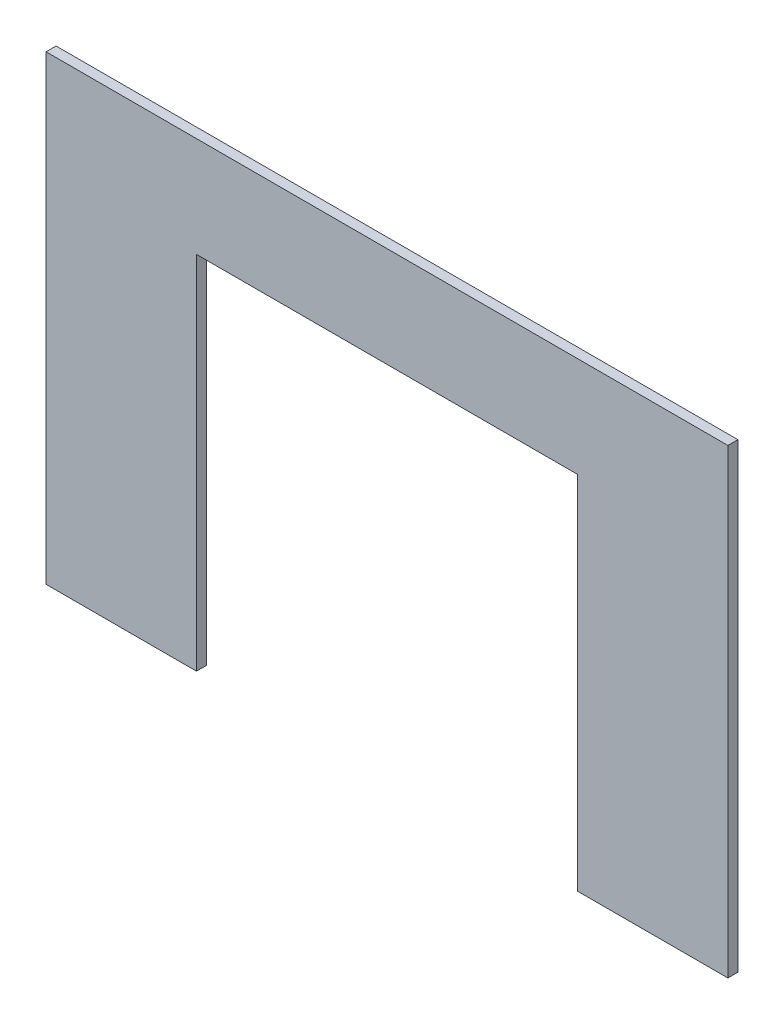
ISO-10303-21;
HEADER;
FILE_DESCRIPTION(('STEP AP214'),'2;1');
FILE_NAME('part.step','',(''),(''),'','','');
FILE_SCHEMA(('AUTOMOTIVE_DESIGN { 1 0 10303 214 1 1 1 1 }'));
ENDSEC;
DATA;
#1=APPLICATION_CONTEXT('core data for automotive mechanical design processes');
#2=APPLICATION_PROTOCOL_DEFINITION('international standard','automotive_design',2000,#1);
#3=PRODUCT_CONTEXT('',#1,'mechanical');
#4=PRODUCT('Part','Part','',(#3));
#5=PRODUCT_RELATED_PRODUCT_CATEGORY('part','',(#4));
#6=PRODUCT_DEFINITION_FORMATION('','',#4);
#7=PRODUCT_DEFINITION_CONTEXT('part definition',#1,'design');
#8=PRODUCT_DEFINITION('design','',#6,#7);
#9=PRODUCT_DEFINITION_SHAPE('','',#8);
#10=(LENGTH_UNIT() NAMED_UNIT(*) SI_UNIT(.MILLI.,.METRE.));
#11=(NAMED_UNIT(*) PLANE_ANGLE_UNIT() SI_UNIT($,.RADIAN.));
#12=(NAMED_UNIT(*) SI_UNIT($,.STERADIAN.) SOLID_ANGLE_UNIT());
#13=UNCERTAINTY_MEASURE_WITH_UNIT(LENGTH_MEASURE(1.E-05),#10,'distance_accuracy_value','');
#14=(GEOMETRIC_REPRESENTATION_CONTEXT(3) GLOBAL_UNCERTAINTY_ASSIGNED_CONTEXT((#13)) GLOBAL_UNIT_ASSIGNED_CONTEXT((#10,
#11,#12)) REPRESENTATION_CONTEXT('',''));
#15=CARTESIAN_POINT('',(0.,0.,0.));
#16=DIRECTION('',(0.,0.,1.));
#17=DIRECTION('',(1.,0.,0.));
#18=AXIS2_PLACEMENT_3D('',#15,#16,#17);
#19=CARTESIAN_POINT('',(431.8,304.8,6.35));
#20=DIRECTION('',(-1.,0.,0.));
#21=DIRECTION('',(0.,0.,1.));
#22=AXIS2_PLACEMENT_3D('',#19,#20,#21);
#23=PLANE('',#22);
#24=DIRECTION('',(0.,1.,0.));
#25=VECTOR('',#24,1.);
#26=CARTESIAN_POINT('',(431.8,304.8,0.));
#27=LINE('',#26,#25);
#28=CARTESIAN_POINT('',(431.8,12.7000000000001,0.));
#29=VERTEX_POINT('',#28);
#30=CARTESIAN_POINT('',(431.8,304.8,0.));
#31=VERTEX_POINT('',#30);
#32=EDGE_CURVE('E129',#29,#31,#27,.T.);
#33=ORIENTED_EDGE('',*,*,#32,.T.);
#34=DIRECTION('',(0.,0.,-1.));
#35=VECTOR('',#34,1.);
#36=CARTESIAN_POINT('',(431.8,304.8,6.35));
#37=LINE('',#36,#35);
#38=CARTESIAN_POINT('',(431.8,304.8,6.35));
#39=VERTEX_POINT('',#38);
#40=EDGE_CURVE('E11',#39,#31,#37,.T.);
#41=ORIENTED_EDGE('',*,*,#40,.F.);
#42=DIRECTION('',(0.,1.,0.));
#43=VECTOR('',#42,1.);
#44=CARTESIAN_POINT('',(431.8,304.8,6.35));
#45=LINE('',#44,#43);
#46=CARTESIAN_POINT('',(431.8,12.7000000000001,6.35));
#47=VERTEX_POINT('',#46);
#48=EDGE_CURVE('E143',#47,#39,#45,.T.);
#49=ORIENTED_EDGE('',*,*,#48,.F.);
#50=DIRECTION('',(0.,0.,-1.));
#51=VECTOR('',#50,1.);
#52=CARTESIAN_POINT('',(431.8,12.7000000000001,6.35));
#53=LINE('',#52,#51);
#54=EDGE_CURVE('E125',#47,#29,#53,.T.);
#55=ORIENTED_EDGE('',*,*,#54,.T.);
#56=EDGE_LOOP('',(#33,#41,#49,#55));
#57=FACE_BOUND('',#56,.T.);
#58=ADVANCED_FACE('F33',(#57),#23,.F.);
#59=CARTESIAN_POINT('',(0.,304.8,6.35));
#60=DIRECTION('',(0.,-1.,0.));
#61=DIRECTION('',(0.,0.,-1.));
#62=AXIS2_PLACEMENT_3D('',#59,#60,#61);
#63=PLANE('',#62);
#64=DIRECTION('',(-1.,0.,0.));
#65=VECTOR('',#64,1.);
#66=CARTESIAN_POINT('',(0.,304.8,0.));
#67=LINE('',#66,#65);
#68=CARTESIAN_POINT('',(0.,304.8,0.));
#69=VERTEX_POINT('',#68);
#70=EDGE_CURVE('E132',#31,#69,#67,.T.);
#71=ORIENTED_EDGE('',*,*,#70,.T.);
#72=DIRECTION('',(0.,0.,-1.));
#73=VECTOR('',#72,1.);
#74=CARTESIAN_POINT('',(0.,304.8,6.35));
#75=LINE('',#74,#73);
#76=CARTESIAN_POINT('',(0.,304.8,6.35));
#77=VERTEX_POINT('',#76);
#78=EDGE_CURVE('E41',#77,#69,#75,.T.);
#79=ORIENTED_EDGE('',*,*,#78,.F.);
#80=DIRECTION('',(-1.,0.,0.));
#81=VECTOR('',#80,1.);
#82=CARTESIAN_POINT('',(0.,304.8,6.35));
#83=LINE('',#82,#81);
#84=EDGE_CURVE('E92',#39,#77,#83,.T.);
#85=ORIENTED_EDGE('',*,*,#84,.F.);
#86=ORIENTED_EDGE('',*,*,#40,.T.);
#87=EDGE_LOOP('',(#71,#79,#85,#86));
#88=FACE_BOUND('',#87,.T.);
#89=ADVANCED_FACE('F178',(#88),#63,.F.);
#90=CARTESIAN_POINT('',(0.,12.7,6.35));
#91=DIRECTION('',(1.,0.,0.));
#92=DIRECTION('',(0.,0.,-1.));
#93=AXIS2_PLACEMENT_3D('',#90,#91,#92);
#94=PLANE('',#93);
#95=DIRECTION('',(0.,-1.,0.));
#96=VECTOR('',#95,1.);
#97=CARTESIAN_POINT('',(0.,12.7,0.));
#98=LINE('',#97,#96);
#99=CARTESIAN_POINT('',(0.,12.7,0.));
#100=VERTEX_POINT('',#99);
#101=EDGE_CURVE('E134',#69,#100,#98,.T.);
#102=ORIENTED_EDGE('',*,*,#101,.T.);
#103=DIRECTION('',(0.,0.,-1.));
#104=VECTOR('',#103,1.);
#105=CARTESIAN_POINT('',(0.,12.7,6.35));
#106=LINE('',#105,#104);
#107=CARTESIAN_POINT('',(0.,12.7,6.35));
#108=VERTEX_POINT('',#107);
#109=EDGE_CURVE('E150',#108,#100,#106,.T.);
#110=ORIENTED_EDGE('',*,*,#109,.F.);
#111=DIRECTION('',(0.,-1.,0.));
#112=VECTOR('',#111,1.);
#113=CARTESIAN_POINT('',(0.,12.7,6.35));
#114=LINE('',#113,#112);
#115=EDGE_CURVE('E158',#77,#108,#114,.T.);
#116=ORIENTED_EDGE('',*,*,#115,.F.);
#117=ORIENTED_EDGE('',*,*,#78,.T.);
#118=EDGE_LOOP('',(#102,#110,#116,#117));
#119=FACE_BOUND('',#118,.T.);
#120=ADVANCED_FACE('F156',(#119),#94,.F.);
#121=CARTESIAN_POINT('',(95.25,12.7,6.35));
#122=DIRECTION('',(0.,1.,0.));
#123=DIRECTION('',(-1.,0.,0.));
#124=AXIS2_PLACEMENT_3D('',#121,#122,#123);
#125=PLANE('',#124);
#126=DIRECTION('',(1.,0.,0.));
#127=VECTOR('',#126,1.);
#128=CARTESIAN_POINT('',(95.25,12.7,0.));
#129=LINE('',#128,#127);
#130=CARTESIAN_POINT('',(95.25,12.7,0.));
#131=VERTEX_POINT('',#130);
#132=EDGE_CURVE('E136',#100,#131,#129,.T.);
#133=ORIENTED_EDGE('',*,*,#132,.T.);
#134=DIRECTION('',(0.,0.,-1.));
#135=VECTOR('',#134,1.);
#136=CARTESIAN_POINT('',(95.25,12.7,6.35));
#137=LINE('',#136,#135);
#138=CARTESIAN_POINT('',(95.25,12.7,6.35));
#139=VERTEX_POINT('',#138);
#140=EDGE_CURVE('E147',#139,#131,#137,.T.);
#141=ORIENTED_EDGE('',*,*,#140,.F.);
#142=DIRECTION('',(1.,0.,0.));
#143=VECTOR('',#142,1.);
#144=CARTESIAN_POINT('',(95.25,12.7,6.35));
#145=LINE('',#144,#143);
#146=EDGE_CURVE('E170',#108,#139,#145,.T.);
#147=ORIENTED_EDGE('',*,*,#146,.F.);
#148=ORIENTED_EDGE('',*,*,#109,.T.);
#149=EDGE_LOOP('',(#133,#141,#147,#148));
#150=FACE_BOUND('',#149,.T.);
#151=ADVANCED_FACE('F166',(#150),#125,.F.);
#152=CARTESIAN_POINT('',(95.25,241.3,6.35));
#153=DIRECTION('',(-1.,0.,0.));
#154=DIRECTION('',(0.,-1.,0.));
#155=AXIS2_PLACEMENT_3D('',#152,#153,#154);
#156=PLANE('',#155);
#157=DIRECTION('',(0.,1.,0.));
#158=VECTOR('',#157,1.);
#159=CARTESIAN_POINT('',(95.25,241.3,0.));
#160=LINE('',#159,#158);
#161=CARTESIAN_POINT('',(95.25,241.3,0.));
#162=VERTEX_POINT('',#161);
#163=EDGE_CURVE('E138',#131,#162,#160,.T.);
#164=ORIENTED_EDGE('',*,*,#163,.T.);
#165=DIRECTION('',(0.,0.,-1.));
#166=VECTOR('',#165,1.);
#167=CARTESIAN_POINT('',(95.25,241.3,6.35));
#168=LINE('',#167,#166);
#169=CARTESIAN_POINT('',(95.25,241.3,6.35));
#170=VERTEX_POINT('',#169);
#171=EDGE_CURVE('E120',#170,#162,#168,.T.);
#172=ORIENTED_EDGE('',*,*,#171,.F.);
#173=DIRECTION('',(0.,1.,0.));
#174=VECTOR('',#173,1.);
#175=CARTESIAN_POINT('',(95.25,241.3,6.35));
#176=LINE('',#175,#174);
#177=EDGE_CURVE('E111',#139,#170,#176,.T.);
#178=ORIENTED_EDGE('',*,*,#177,.F.);
#179=ORIENTED_EDGE('',*,*,#140,.T.);
#180=EDGE_LOOP('',(#164,#172,#178,#179));
#181=FACE_BOUND('',#180,.T.);
#182=ADVANCED_FACE('F169',(#181),#156,.F.);
#183=CARTESIAN_POINT('',(336.55,241.3,6.35));
#184=DIRECTION('',(0.,1.,0.));
#185=DIRECTION('',(-1.,0.,0.));
#186=AXIS2_PLACEMENT_3D('',#183,#184,#185);
#187=PLANE('',#186);
#188=DIRECTION('',(1.,0.,0.));
#189=VECTOR('',#188,1.);
#190=CARTESIAN_POINT('',(336.55,241.3,0.));
#191=LINE('',#190,#189);
#192=CARTESIAN_POINT('',(336.55,241.3,0.));
#193=VERTEX_POINT('',#192);
#194=EDGE_CURVE('E119',#162,#193,#191,.T.);
#195=ORIENTED_EDGE('',*,*,#194,.T.);
#196=DIRECTION('',(0.,0.,-1.));
#197=VECTOR('',#196,1.);
#198=CARTESIAN_POINT('',(336.55,241.3,6.35));
#199=LINE('',#198,#197);
#200=CARTESIAN_POINT('',(336.55,241.3,6.35));
#201=VERTEX_POINT('',#200);
#202=EDGE_CURVE('E116',#201,#193,#199,.T.);
#203=ORIENTED_EDGE('',*,*,#202,.F.);
#204=DIRECTION('',(1.,0.,0.));
#205=VECTOR('',#204,1.);
#206=CARTESIAN_POINT('',(336.55,241.3,6.35));
#207=LINE('',#206,#205);
#208=EDGE_CURVE('E105',#170,#201,#207,.T.);
#209=ORIENTED_EDGE('',*,*,#208,.F.);
#210=ORIENTED_EDGE('',*,*,#171,.T.);
#211=EDGE_LOOP('',(#195,#203,#209,#210));
#212=FACE_BOUND('',#211,.T.);
#213=ADVANCED_FACE('F117',(#212),#187,.F.);
#214=CARTESIAN_POINT('',(336.55,12.7,6.35));
#215=DIRECTION('',(1.,0.,0.));
#216=DIRECTION('',(0.,0.,-1.));
#217=AXIS2_PLACEMENT_3D('',#214,#215,#216);
#218=PLANE('',#217);
#219=DIRECTION('',(0.,-1.,0.));
#220=VECTOR('',#219,1.);
#221=CARTESIAN_POINT('',(336.55,12.7,0.));
#222=LINE('',#221,#220);
#223=CARTESIAN_POINT('',(336.55,12.7,0.));
#224=VERTEX_POINT('',#223);
#225=EDGE_CURVE('E78',#193,#224,#222,.T.);
#226=ORIENTED_EDGE('',*,*,#225,.T.);
#227=DIRECTION('',(0.,0.,-1.));
#228=VECTOR('',#227,1.);
#229=CARTESIAN_POINT('',(336.55,12.7,6.35));
#230=LINE('',#229,#228);
#231=CARTESIAN_POINT('',(336.55,12.7,6.35));
#232=VERTEX_POINT('',#231);
#233=EDGE_CURVE('E121',#232,#224,#230,.T.);
#234=ORIENTED_EDGE('',*,*,#233,.F.);
#235=DIRECTION('',(0.,-1.,0.));
#236=VECTOR('',#235,1.);
#237=CARTESIAN_POINT('',(336.55,12.7,6.35));
#238=LINE('',#237,#236);
#239=EDGE_CURVE('E109',#201,#232,#238,.T.);
#240=ORIENTED_EDGE('',*,*,#239,.F.);
#241=ORIENTED_EDGE('',*,*,#202,.T.);
#242=EDGE_LOOP('',(#226,#234,#240,#241));
#243=FACE_BOUND('',#242,.T.);
#244=ADVANCED_FACE('F123',(#243),#218,.F.);
#245=CARTESIAN_POINT('',(431.8,12.7000000000001,6.35));
#246=DIRECTION('',(0.,1.,0.));
#247=DIRECTION('',(-1.,0.,0.));
#248=AXIS2_PLACEMENT_3D('',#245,#246,#247);
#249=PLANE('',#248);
#250=DIRECTION('',(1.,0.,0.));
#251=VECTOR('',#250,1.);
#252=CARTESIAN_POINT('',(431.8,12.7000000000001,0.));
#253=LINE('',#252,#251);
#254=EDGE_CURVE('E84',#224,#29,#253,.T.);
#255=ORIENTED_EDGE('',*,*,#254,.T.);
#256=ORIENTED_EDGE('',*,*,#54,.F.);
#257=DIRECTION('',(1.,0.,0.));
#258=VECTOR('',#257,1.);
#259=CARTESIAN_POINT('',(431.8,12.7000000000001,6.35));
#260=LINE('',#259,#258);
#261=EDGE_CURVE('E49',#232,#47,#260,.T.);
#262=ORIENTED_EDGE('',*,*,#261,.F.);
#263=ORIENTED_EDGE('',*,*,#233,.T.);
#264=EDGE_LOOP('',(#255,#256,#262,#263));
#265=FACE_BOUND('',#264,.T.);
#266=ADVANCED_FACE('F194',(#265),#249,.F.);
#267=CARTESIAN_POINT('',(0.,0.,6.35));
#268=DIRECTION('',(0.,0.,-1.));
#269=DIRECTION('',(-1.,0.,0.));
#270=AXIS2_PLACEMENT_3D('',#267,#268,#269);
#271=PLANE('',#270);
#272=ORIENTED_EDGE('',*,*,#48,.T.);
#273=ORIENTED_EDGE('',*,*,#84,.T.);
#274=ORIENTED_EDGE('',*,*,#115,.T.);
#275=ORIENTED_EDGE('',*,*,#146,.T.);
#276=ORIENTED_EDGE('',*,*,#177,.T.);
#277=ORIENTED_EDGE('',*,*,#208,.T.);
#278=ORIENTED_EDGE('',*,*,#239,.T.);
#279=ORIENTED_EDGE('',*,*,#261,.T.);
#280=EDGE_LOOP('',(#272,#273,#274,#275,#276,#277,#278,#279));
#281=FACE_BOUND('',#280,.T.);
#282=ADVANCED_FACE('F107',(#281),#271,.F.);
#283=CARTESIAN_POINT('',(0.,0.,0.));
#284=DIRECTION('',(0.,0.,-1.));
#285=DIRECTION('',(-1.,0.,0.));
#286=AXIS2_PLACEMENT_3D('',#283,#284,#285);
#287=PLANE('',#286);
#288=ORIENTED_EDGE('',*,*,#32,.F.);
#289=ORIENTED_EDGE('',*,*,#254,.F.);
#290=ORIENTED_EDGE('',*,*,#225,.F.);
#291=ORIENTED_EDGE('',*,*,#194,.F.);
#292=ORIENTED_EDGE('',*,*,#163,.F.);
#293=ORIENTED_EDGE('',*,*,#132,.F.);
#294=ORIENTED_EDGE('',*,*,#101,.F.);
#295=ORIENTED_EDGE('',*,*,#70,.F.);
#296=EDGE_LOOP('',(#288,#289,#290,#291,#292,#293,#294,#295));
#297=FACE_BOUND('',#296,.T.);
#298=ADVANCED_FACE('F162',(#297),#287,.T.);
#299=CLOSED_SHELL('',(#58,#89,#120,#151,#182,#213,#244,#266,#282,#298));
#300=MANIFOLD_SOLID_BREP('B2',#299);
#301=ADVANCED_BREP_SHAPE_REPRESENTATION('',(#18,#300),#14);
#302=SHAPE_DEFINITION_REPRESENTATION(#9,#301);
ENDSEC;
END-ISO-10303-21;
